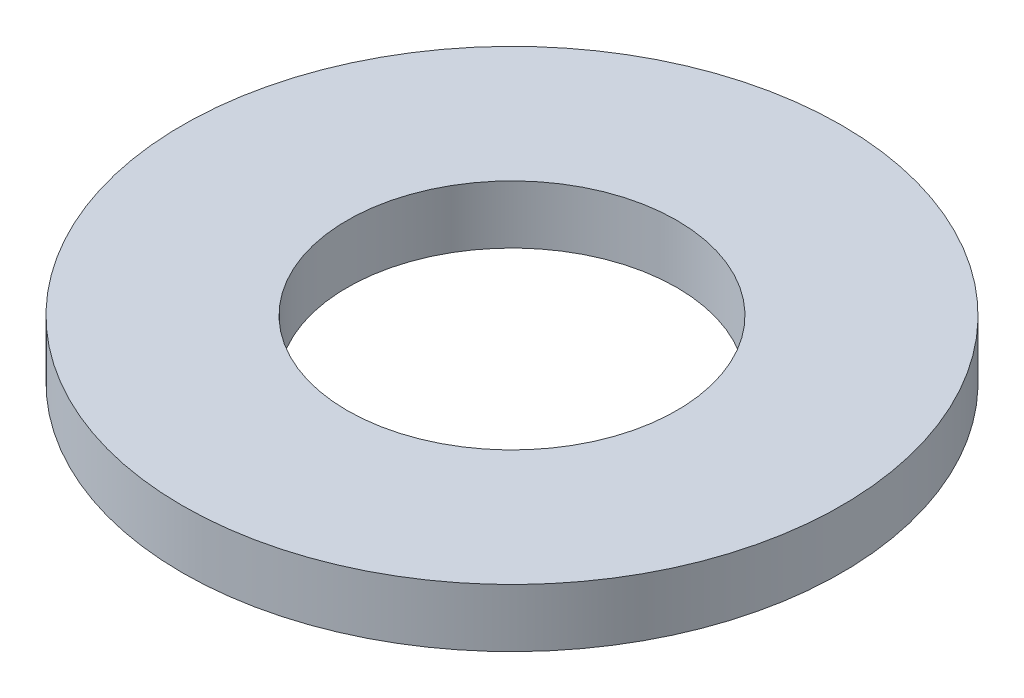
ISO-10303-21;
HEADER;
FILE_DESCRIPTION(('STEP AP214'),'2;1');
FILE_NAME('part.step','',(''),(''),'','','');
FILE_SCHEMA(('AUTOMOTIVE_DESIGN { 1 0 10303 214 1 1 1 1 }'));
ENDSEC;
DATA;
#1=APPLICATION_CONTEXT('core data for automotive mechanical design processes');
#2=APPLICATION_PROTOCOL_DEFINITION('international standard','automotive_design',2000,#1);
#3=PRODUCT_CONTEXT('',#1,'mechanical');
#4=PRODUCT('Part','Part','',(#3));
#5=PRODUCT_RELATED_PRODUCT_CATEGORY('part','',(#4));
#6=PRODUCT_DEFINITION_FORMATION('','',#4);
#7=PRODUCT_DEFINITION_CONTEXT('part definition',#1,'design');
#8=PRODUCT_DEFINITION('design','',#6,#7);
#9=PRODUCT_DEFINITION_SHAPE('','',#8);
#10=(LENGTH_UNIT() NAMED_UNIT(*) SI_UNIT(.MILLI.,.METRE.));
#11=(NAMED_UNIT(*) PLANE_ANGLE_UNIT() SI_UNIT($,.RADIAN.));
#12=(NAMED_UNIT(*) SI_UNIT($,.STERADIAN.) SOLID_ANGLE_UNIT());
#13=UNCERTAINTY_MEASURE_WITH_UNIT(LENGTH_MEASURE(1.E-05),#10,'distance_accuracy_value','');
#14=(GEOMETRIC_REPRESENTATION_CONTEXT(3) GLOBAL_UNCERTAINTY_ASSIGNED_CONTEXT((#13)) GLOBAL_UNIT_ASSIGNED_CONTEXT((#10,
#11,#12)) REPRESENTATION_CONTEXT('',''));
#15=CARTESIAN_POINT('',(0.,0.,0.));
#16=DIRECTION('',(0.,0.,1.));
#17=DIRECTION('',(1.,0.,0.));
#18=AXIS2_PLACEMENT_3D('',#15,#16,#17);
#19=CARTESIAN_POINT('',(0.,15.,0.));
#20=DIRECTION('',(0.,-1.,0.));
#21=DIRECTION('',(0.,0.,-1.));
#22=AXIS2_PLACEMENT_3D('',#19,#20,#21);
#23=CYLINDRICAL_SURFACE('',#22,85.);
#24=CARTESIAN_POINT('',(0.,15.,0.));
#25=DIRECTION('',(0.,1.,0.));
#26=DIRECTION('',(0.,0.,1.));
#27=AXIS2_PLACEMENT_3D('',#24,#25,#26);
#28=CIRCLE('',#27,85.);
#29=CARTESIAN_POINT('',(0.,15.,85.));
#30=VERTEX_POINT('',#29);
#31=EDGE_CURVE('E10',#30,#30,#28,.T.);
#32=ORIENTED_EDGE('',*,*,#31,.F.);
#33=EDGE_LOOP('',(#32));
#34=FACE_BOUND('',#33,.T.);
#35=CARTESIAN_POINT('',(0.,0.,0.));
#36=DIRECTION('',(0.,1.,0.));
#37=DIRECTION('',(0.,0.,1.));
#38=AXIS2_PLACEMENT_3D('',#35,#36,#37);
#39=CIRCLE('',#38,85.);
#40=CARTESIAN_POINT('',(0.,0.,85.));
#41=VERTEX_POINT('',#40);
#42=EDGE_CURVE('E37',#41,#41,#39,.T.);
#43=ORIENTED_EDGE('',*,*,#42,.T.);
#44=EDGE_LOOP('',(#43));
#45=FACE_BOUND('',#44,.T.);
#46=ADVANCED_FACE('F40',(#34,#45),#23,.T.);
#47=CARTESIAN_POINT('',(0.,15.,0.));
#48=DIRECTION('',(0.,1.,0.));
#49=DIRECTION('',(0.,0.,1.));
#50=AXIS2_PLACEMENT_3D('',#47,#48,#49);
#51=PLANE('',#50);
#52=CARTESIAN_POINT('',(0.,15.,0.));
#53=DIRECTION('',(0.,1.,0.));
#54=DIRECTION('',(0.,0.,1.));
#55=AXIS2_PLACEMENT_3D('',#52,#53,#54);
#56=CIRCLE('',#55,42.5);
#57=CARTESIAN_POINT('',(0.,15.,42.5));
#58=VERTEX_POINT('',#57);
#59=EDGE_CURVE('E50',#58,#58,#56,.T.);
#60=ORIENTED_EDGE('',*,*,#59,.F.);
#61=EDGE_LOOP('',(#60));
#62=FACE_BOUND('',#61,.T.);
#63=ORIENTED_EDGE('',*,*,#31,.T.);
#64=EDGE_LOOP('',(#63));
#65=FACE_BOUND('',#64,.T.);
#66=ADVANCED_FACE('F59',(#62,#65),#51,.T.);
#67=CARTESIAN_POINT('',(0.,0.,0.));
#68=DIRECTION('',(0.,1.,0.));
#69=DIRECTION('',(0.,0.,1.));
#70=AXIS2_PLACEMENT_3D('',#67,#68,#69);
#71=PLANE('',#70);
#72=CARTESIAN_POINT('',(0.,0.,0.));
#73=DIRECTION('',(0.,1.,0.));
#74=DIRECTION('',(0.,0.,1.));
#75=AXIS2_PLACEMENT_3D('',#72,#73,#74);
#76=CIRCLE('',#75,42.5);
#77=CARTESIAN_POINT('',(0.,0.,42.5));
#78=VERTEX_POINT('',#77);
#79=EDGE_CURVE('E47',#78,#78,#76,.T.);
#80=ORIENTED_EDGE('',*,*,#79,.T.);
#81=EDGE_LOOP('',(#80));
#82=FACE_BOUND('',#81,.T.);
#83=ORIENTED_EDGE('',*,*,#42,.F.);
#84=EDGE_LOOP('',(#83));
#85=FACE_BOUND('',#84,.T.);
#86=ADVANCED_FACE('F58',(#82,#85),#71,.F.);
#87=CARTESIAN_POINT('',(0.,15.,0.));
#88=DIRECTION('',(0.,-1.,0.));
#89=DIRECTION('',(0.,0.,-1.));
#90=AXIS2_PLACEMENT_3D('',#87,#88,#89);
#91=CYLINDRICAL_SURFACE('',#90,42.5);
#92=ORIENTED_EDGE('',*,*,#59,.T.);
#93=EDGE_LOOP('',(#92));
#94=FACE_BOUND('',#93,.T.);
#95=ORIENTED_EDGE('',*,*,#79,.F.);
#96=EDGE_LOOP('',(#95));
#97=FACE_BOUND('',#96,.T.);
#98=ADVANCED_FACE('F54',(#94,#97),#91,.F.);
#99=CLOSED_SHELL('',(#46,#66,#86,#98));
#100=MANIFOLD_SOLID_BREP('B2',#99);
#101=ADVANCED_BREP_SHAPE_REPRESENTATION('',(#18,#100),#14);
#102=SHAPE_DEFINITION_REPRESENTATION(#9,#101);
ENDSEC;
END-ISO-10303-21;
